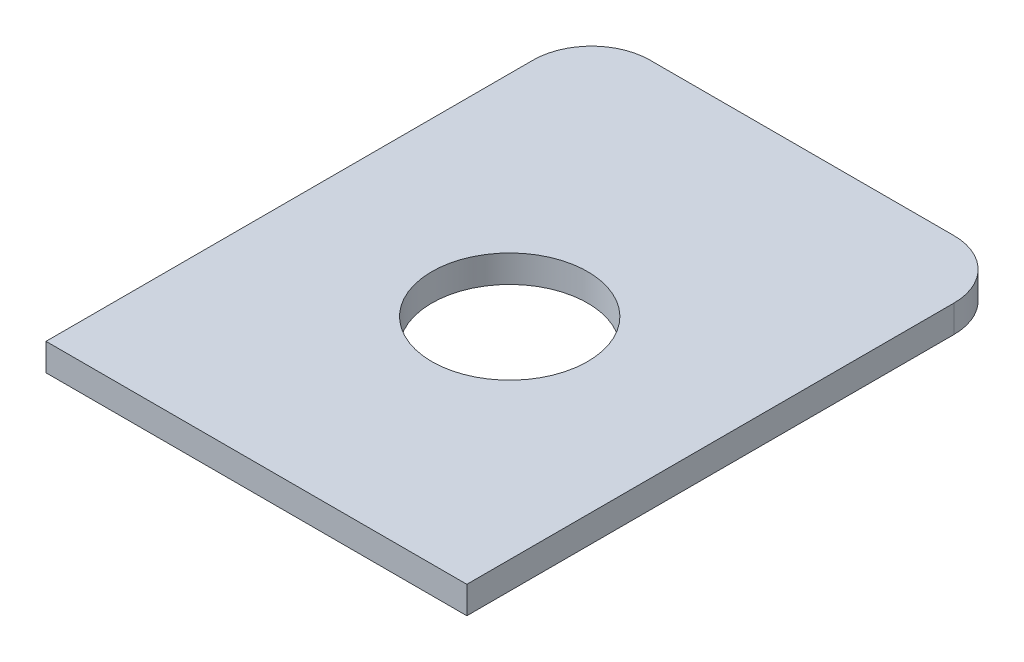
ISO-10303-21;
HEADER;
FILE_DESCRIPTION(('STEP AP214'),'2;1');
FILE_NAME('part.step','',(''),(''),'','','');
FILE_SCHEMA(('AUTOMOTIVE_DESIGN { 1 0 10303 214 1 1 1 1 }'));
ENDSEC;
DATA;
#1=APPLICATION_CONTEXT('core data for automotive mechanical design processes');
#2=APPLICATION_PROTOCOL_DEFINITION('international standard','automotive_design',2000,#1);
#3=PRODUCT_CONTEXT('',#1,'mechanical');
#4=PRODUCT('Part','Part','',(#3));
#5=PRODUCT_RELATED_PRODUCT_CATEGORY('part','',(#4));
#6=PRODUCT_DEFINITION_FORMATION('','',#4);
#7=PRODUCT_DEFINITION_CONTEXT('part definition',#1,'design');
#8=PRODUCT_DEFINITION('design','',#6,#7);
#9=PRODUCT_DEFINITION_SHAPE('','',#8);
#10=(LENGTH_UNIT() NAMED_UNIT(*) SI_UNIT(.MILLI.,.METRE.));
#11=(NAMED_UNIT(*) PLANE_ANGLE_UNIT() SI_UNIT($,.RADIAN.));
#12=(NAMED_UNIT(*) SI_UNIT($,.STERADIAN.) SOLID_ANGLE_UNIT());
#13=UNCERTAINTY_MEASURE_WITH_UNIT(LENGTH_MEASURE(1.E-05),#10,'distance_accuracy_value','');
#14=(GEOMETRIC_REPRESENTATION_CONTEXT(3) GLOBAL_UNCERTAINTY_ASSIGNED_CONTEXT((#13)) GLOBAL_UNIT_ASSIGNED_CONTEXT((#10,
#11,#12)) REPRESENTATION_CONTEXT('',''));
#15=CARTESIAN_POINT('',(0.,0.,0.));
#16=DIRECTION('',(0.,0.,1.));
#17=DIRECTION('',(1.,0.,0.));
#18=AXIS2_PLACEMENT_3D('',#15,#16,#17);
#19=CARTESIAN_POINT('',(-7.9824365322079,19.3504195270786,-68.8198540020841));
#20=DIRECTION('',(0.,1.,0.));
#21=DIRECTION('',(0.,0.,1.));
#22=AXIS2_PLACEMENT_3D('',#19,#20,#21);
#23=PLANE('',#22);
#24=CARTESIAN_POINT('',(-5.86092041698448,19.3504195270786,-63.7));
#25=DIRECTION('',(0.,1.,0.));
#26=DIRECTION('',(0.,0.,1.));
#27=AXIS2_PLACEMENT_3D('',#24,#25,#26);
#28=CIRCLE('',#27,4.);
#29=CARTESIAN_POINT('',(-5.86092041698448,19.3504195270786,-59.7));
#30=VERTEX_POINT('',#29);
#31=EDGE_CURVE('E101',#30,#30,#28,.F.);
#32=ORIENTED_EDGE('',*,*,#31,.T.);
#33=EDGE_LOOP('',(#32));
#34=FACE_BOUND('',#33,.T.);
#35=DIRECTION('',(0.,0.,1.));
#36=VECTOR('',#35,1.);
#37=CARTESIAN_POINT('',(-16.6609204169845,19.3504195270786,-78.7));
#38=LINE('',#37,#36);
#39=CARTESIAN_POINT('',(-16.6609204169845,19.3504195270786,-50.7));
#40=VERTEX_POINT('',#39);
#41=CARTESIAN_POINT('',(-16.6609204169845,19.3504195270786,-75.7));
#42=VERTEX_POINT('',#41);
#43=EDGE_CURVE('E115',#40,#42,#38,.F.);
#44=ORIENTED_EDGE('',*,*,#43,.F.);
#45=DIRECTION('',(1.,0.,0.));
#46=VECTOR('',#45,1.);
#47=CARTESIAN_POINT('',(-16.6609204169845,19.3504195270786,-50.7));
#48=LINE('',#47,#46);
#49=CARTESIAN_POINT('',(4.93907958301552,19.3504195270786,-50.7));
#50=VERTEX_POINT('',#49);
#51=EDGE_CURVE('E109',#50,#40,#48,.F.);
#52=ORIENTED_EDGE('',*,*,#51,.F.);
#53=DIRECTION('',(0.,0.,-1.));
#54=VECTOR('',#53,1.);
#55=CARTESIAN_POINT('',(4.93907958301552,19.3504195270786,-50.7));
#56=LINE('',#55,#54);
#57=CARTESIAN_POINT('',(4.93907958301552,19.3504195270786,-75.7));
#58=VERTEX_POINT('',#57);
#59=EDGE_CURVE('E71',#58,#50,#56,.F.);
#60=ORIENTED_EDGE('',*,*,#59,.F.);
#61=CARTESIAN_POINT('',(1.93907958301552,19.3504195270786,-75.7));
#62=DIRECTION('',(0.,1.,0.));
#63=DIRECTION('',(0.,0.,1.));
#64=AXIS2_PLACEMENT_3D('',#61,#62,#63);
#65=CIRCLE('',#64,3.);
#66=CARTESIAN_POINT('',(1.93907958301552,19.3504195270786,-78.7));
#67=VERTEX_POINT('',#66);
#68=EDGE_CURVE('E21',#67,#58,#65,.F.);
#69=ORIENTED_EDGE('',*,*,#68,.F.);
#70=DIRECTION('',(-1.,0.,0.));
#71=VECTOR('',#70,1.);
#72=CARTESIAN_POINT('',(4.93907958301552,19.3504195270786,-78.7));
#73=LINE('',#72,#71);
#74=CARTESIAN_POINT('',(-13.6609204169845,19.3504195270786,-78.7));
#75=VERTEX_POINT('',#74);
#76=EDGE_CURVE('E60',#75,#67,#73,.F.);
#77=ORIENTED_EDGE('',*,*,#76,.F.);
#78=CARTESIAN_POINT('',(-13.6609204169845,19.3504195270786,-75.7));
#79=DIRECTION('',(0.,1.,0.));
#80=DIRECTION('',(0.,0.,1.));
#81=AXIS2_PLACEMENT_3D('',#78,#79,#80);
#82=CIRCLE('',#81,3.);
#83=EDGE_CURVE('E129',#42,#75,#82,.F.);
#84=ORIENTED_EDGE('',*,*,#83,.F.);
#85=EDGE_LOOP('',(#44,#52,#60,#69,#77,#84));
#86=FACE_BOUND('',#85,.T.);
#87=ADVANCED_FACE('F18',(#34,#86),#23,.T.);
#88=CARTESIAN_POINT('',(-16.6609204169845,19.3504195270786,-78.7));
#89=DIRECTION('',(-1.,0.,0.));
#90=DIRECTION('',(0.,0.,1.));
#91=AXIS2_PLACEMENT_3D('',#88,#89,#90);
#92=PLANE('',#91);
#93=ORIENTED_EDGE('',*,*,#43,.T.);
#94=DIRECTION('',(0.,1.,0.));
#95=VECTOR('',#94,1.);
#96=CARTESIAN_POINT('',(-16.6609204169845,19.3504195270786,-75.7));
#97=LINE('',#96,#95);
#98=CARTESIAN_POINT('',(-16.6609204169845,17.9504195270786,-75.7));
#99=VERTEX_POINT('',#98);
#100=EDGE_CURVE('E130',#99,#42,#97,.T.);
#101=ORIENTED_EDGE('',*,*,#100,.F.);
#102=DIRECTION('',(0.,0.,1.));
#103=VECTOR('',#102,1.);
#104=CARTESIAN_POINT('',(-16.6609204169845,17.9504195270786,-68.8198540020841));
#105=LINE('',#104,#103);
#106=CARTESIAN_POINT('',(-16.6609204169845,17.9504195270786,-50.7));
#107=VERTEX_POINT('',#106);
#108=EDGE_CURVE('E99',#99,#107,#105,.T.);
#109=ORIENTED_EDGE('',*,*,#108,.T.);
#110=DIRECTION('',(0.,-1.,0.));
#111=VECTOR('',#110,1.);
#112=CARTESIAN_POINT('',(-16.6609204169845,19.3504195270786,-50.7));
#113=LINE('',#112,#111);
#114=EDGE_CURVE('E98',#40,#107,#113,.T.);
#115=ORIENTED_EDGE('',*,*,#114,.F.);
#116=EDGE_LOOP('',(#93,#101,#109,#115));
#117=FACE_BOUND('',#116,.T.);
#118=ADVANCED_FACE('F179',(#117),#92,.T.);
#119=CARTESIAN_POINT('',(-16.6609204169845,19.3504195270786,-50.7));
#120=DIRECTION('',(0.,0.,1.));
#121=DIRECTION('',(0.,-1.,0.));
#122=AXIS2_PLACEMENT_3D('',#119,#120,#121);
#123=PLANE('',#122);
#124=DIRECTION('',(1.,0.,0.));
#125=VECTOR('',#124,1.);
#126=CARTESIAN_POINT('',(-7.9824365322079,17.9504195270786,-50.7));
#127=LINE('',#126,#125);
#128=CARTESIAN_POINT('',(4.93907958301552,17.9504195270786,-50.7));
#129=VERTEX_POINT('',#128);
#130=EDGE_CURVE('E91',#107,#129,#127,.T.);
#131=ORIENTED_EDGE('',*,*,#130,.T.);
#132=DIRECTION('',(0.,1.,0.));
#133=VECTOR('',#132,1.);
#134=CARTESIAN_POINT('',(4.93907958301552,19.3504195270786,-50.7));
#135=LINE('',#134,#133);
#136=EDGE_CURVE('E79',#50,#129,#135,.F.);
#137=ORIENTED_EDGE('',*,*,#136,.F.);
#138=ORIENTED_EDGE('',*,*,#51,.T.);
#139=ORIENTED_EDGE('',*,*,#114,.T.);
#140=EDGE_LOOP('',(#131,#137,#138,#139));
#141=FACE_BOUND('',#140,.T.);
#142=ADVANCED_FACE('F96',(#141),#123,.T.);
#143=CARTESIAN_POINT('',(4.93907958301552,19.3504195270786,-50.7));
#144=DIRECTION('',(1.,0.,0.));
#145=DIRECTION('',(0.,0.,-1.));
#146=AXIS2_PLACEMENT_3D('',#143,#144,#145);
#147=PLANE('',#146);
#148=DIRECTION('',(0.,0.,1.));
#149=VECTOR('',#148,1.);
#150=CARTESIAN_POINT('',(4.93907958301552,17.9504195270786,-68.8198540020841));
#151=LINE('',#150,#149);
#152=CARTESIAN_POINT('',(4.93907958301552,17.9504195270786,-75.7));
#153=VERTEX_POINT('',#152);
#154=EDGE_CURVE('E82',#129,#153,#151,.F.);
#155=ORIENTED_EDGE('',*,*,#154,.T.);
#156=DIRECTION('',(0.,1.,0.));
#157=VECTOR('',#156,1.);
#158=CARTESIAN_POINT('',(4.93907958301552,19.3504195270786,-75.7));
#159=LINE('',#158,#157);
#160=EDGE_CURVE('E114',#58,#153,#159,.F.);
#161=ORIENTED_EDGE('',*,*,#160,.F.);
#162=ORIENTED_EDGE('',*,*,#59,.T.);
#163=ORIENTED_EDGE('',*,*,#136,.T.);
#164=EDGE_LOOP('',(#155,#161,#162,#163));
#165=FACE_BOUND('',#164,.T.);
#166=ADVANCED_FACE('F81',(#165),#147,.T.);
#167=CARTESIAN_POINT('',(1.93907958301552,19.3504195270786,-75.7));
#168=DIRECTION('',(0.,1.,0.));
#169=DIRECTION('',(0.,0.,1.));
#170=AXIS2_PLACEMENT_3D('',#167,#168,#169);
#171=CYLINDRICAL_SURFACE('',#170,3.);
#172=ORIENTED_EDGE('',*,*,#68,.T.);
#173=ORIENTED_EDGE('',*,*,#160,.T.);
#174=CARTESIAN_POINT('',(1.93907958301552,17.9504195270786,-75.7));
#175=DIRECTION('',(0.,1.,0.));
#176=DIRECTION('',(0.,0.,1.));
#177=AXIS2_PLACEMENT_3D('',#174,#175,#176);
#178=CIRCLE('',#177,3.);
#179=CARTESIAN_POINT('',(1.93907958301552,17.9504195270786,-78.7));
#180=VERTEX_POINT('',#179);
#181=EDGE_CURVE('E94',#153,#180,#178,.T.);
#182=ORIENTED_EDGE('',*,*,#181,.T.);
#183=DIRECTION('',(0.,1.,0.));
#184=VECTOR('',#183,1.);
#185=CARTESIAN_POINT('',(1.93907958301552,19.3504195270786,-78.7));
#186=LINE('',#185,#184);
#187=EDGE_CURVE('E113',#67,#180,#186,.F.);
#188=ORIENTED_EDGE('',*,*,#187,.F.);
#189=EDGE_LOOP('',(#172,#173,#182,#188));
#190=FACE_BOUND('',#189,.T.);
#191=ADVANCED_FACE('F139',(#190),#171,.T.);
#192=CARTESIAN_POINT('',(4.93907958301552,19.3504195270786,-78.7));
#193=DIRECTION('',(0.,0.,-1.));
#194=DIRECTION('',(-1.,0.,0.));
#195=AXIS2_PLACEMENT_3D('',#192,#193,#194);
#196=PLANE('',#195);
#197=DIRECTION('',(1.,0.,0.));
#198=VECTOR('',#197,1.);
#199=CARTESIAN_POINT('',(-7.9824365322079,17.9504195270786,-78.7));
#200=LINE('',#199,#198);
#201=CARTESIAN_POINT('',(-13.6609204169845,17.9504195270786,-78.7));
#202=VERTEX_POINT('',#201);
#203=EDGE_CURVE('E126',#180,#202,#200,.F.);
#204=ORIENTED_EDGE('',*,*,#203,.T.);
#205=DIRECTION('',(0.,1.,0.));
#206=VECTOR('',#205,1.);
#207=CARTESIAN_POINT('',(-13.6609204169845,19.3504195270786,-78.7));
#208=LINE('',#207,#206);
#209=EDGE_CURVE('E36',#75,#202,#208,.F.);
#210=ORIENTED_EDGE('',*,*,#209,.F.);
#211=ORIENTED_EDGE('',*,*,#76,.T.);
#212=ORIENTED_EDGE('',*,*,#187,.T.);
#213=EDGE_LOOP('',(#204,#210,#211,#212));
#214=FACE_BOUND('',#213,.T.);
#215=ADVANCED_FACE('F141',(#214),#196,.T.);
#216=CARTESIAN_POINT('',(-13.6609204169845,19.3504195270786,-75.7));
#217=DIRECTION('',(0.,1.,0.));
#218=DIRECTION('',(0.,0.,1.));
#219=AXIS2_PLACEMENT_3D('',#216,#217,#218);
#220=CYLINDRICAL_SURFACE('',#219,3.);
#221=ORIENTED_EDGE('',*,*,#83,.T.);
#222=ORIENTED_EDGE('',*,*,#209,.T.);
#223=CARTESIAN_POINT('',(-13.6609204169845,17.9504195270786,-75.7));
#224=DIRECTION('',(0.,1.,0.));
#225=DIRECTION('',(0.,0.,1.));
#226=AXIS2_PLACEMENT_3D('',#223,#224,#225);
#227=CIRCLE('',#226,3.);
#228=EDGE_CURVE('E27',#202,#99,#227,.T.);
#229=ORIENTED_EDGE('',*,*,#228,.T.);
#230=ORIENTED_EDGE('',*,*,#100,.T.);
#231=EDGE_LOOP('',(#221,#222,#229,#230));
#232=FACE_BOUND('',#231,.T.);
#233=ADVANCED_FACE('F146',(#232),#220,.T.);
#234=CARTESIAN_POINT('',(-5.86092041698448,19.3504195270786,-63.7));
#235=DIRECTION('',(0.,1.,0.));
#236=DIRECTION('',(0.,0.,1.));
#237=AXIS2_PLACEMENT_3D('',#234,#235,#236);
#238=CYLINDRICAL_SURFACE('',#237,4.);
#239=ORIENTED_EDGE('',*,*,#31,.F.);
#240=EDGE_LOOP('',(#239));
#241=FACE_BOUND('',#240,.T.);
#242=CARTESIAN_POINT('',(-5.86092041698448,17.9504195270786,-63.7));
#243=DIRECTION('',(0.,1.,0.));
#244=DIRECTION('',(0.,0.,1.));
#245=AXIS2_PLACEMENT_3D('',#242,#243,#244);
#246=CIRCLE('',#245,4.);
#247=CARTESIAN_POINT('',(-5.86092041698448,17.9504195270786,-59.7));
#248=VERTEX_POINT('',#247);
#249=EDGE_CURVE('E11',#248,#248,#246,.F.);
#250=ORIENTED_EDGE('',*,*,#249,.T.);
#251=EDGE_LOOP('',(#250));
#252=FACE_BOUND('',#251,.T.);
#253=ADVANCED_FACE('F148',(#241,#252),#238,.F.);
#254=CARTESIAN_POINT('',(-7.9824365322079,17.9504195270786,-68.8198540020841));
#255=DIRECTION('',(0.,1.,0.));
#256=DIRECTION('',(0.,0.,1.));
#257=AXIS2_PLACEMENT_3D('',#254,#255,#256);
#258=PLANE('',#257);
#259=ORIENTED_EDGE('',*,*,#249,.F.);
#260=EDGE_LOOP('',(#259));
#261=FACE_BOUND('',#260,.T.);
#262=ORIENTED_EDGE('',*,*,#203,.F.);
#263=ORIENTED_EDGE('',*,*,#181,.F.);
#264=ORIENTED_EDGE('',*,*,#154,.F.);
#265=ORIENTED_EDGE('',*,*,#130,.F.);
#266=ORIENTED_EDGE('',*,*,#108,.F.);
#267=ORIENTED_EDGE('',*,*,#228,.F.);
#268=EDGE_LOOP('',(#262,#263,#264,#265,#266,#267));
#269=FACE_BOUND('',#268,.T.);
#270=ADVANCED_FACE('F90',(#261,#269),#258,.F.);
#271=CLOSED_SHELL('',(#87,#118,#142,#166,#191,#215,#233,#253,#270));
#272=MANIFOLD_SOLID_BREP('B1',#271);
#273=ADVANCED_BREP_SHAPE_REPRESENTATION('',(#18,#272),#14);
#274=SHAPE_DEFINITION_REPRESENTATION(#9,#273);
ENDSEC;
END-ISO-10303-21;
